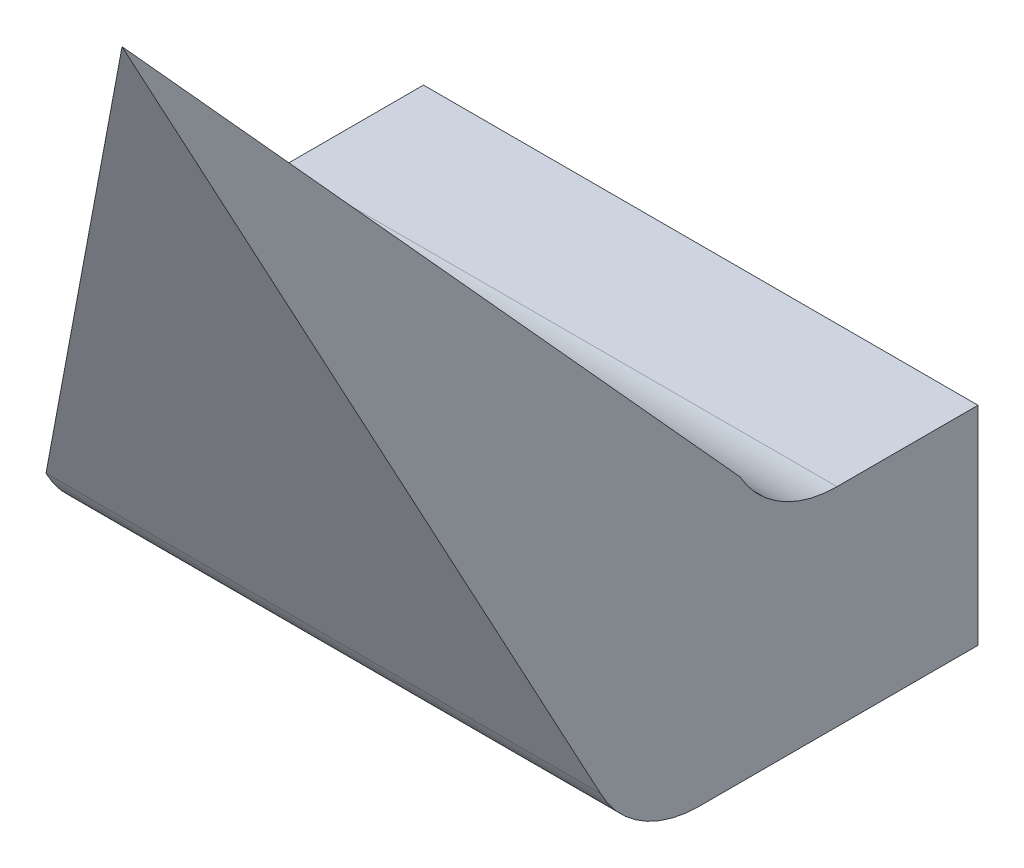
ISO-10303-21;
HEADER;
FILE_DESCRIPTION(('STEP AP214'),'2;1');
FILE_NAME('part.step','',(''),(''),'','','');
FILE_SCHEMA(('AUTOMOTIVE_DESIGN { 1 0 10303 214 1 1 1 1 }'));
ENDSEC;
DATA;
#1=APPLICATION_CONTEXT('core data for automotive mechanical design processes');
#2=APPLICATION_PROTOCOL_DEFINITION('international standard','automotive_design',2000,#1);
#3=PRODUCT_CONTEXT('',#1,'mechanical');
#4=PRODUCT('Part','Part','',(#3));
#5=PRODUCT_RELATED_PRODUCT_CATEGORY('part','',(#4));
#6=PRODUCT_DEFINITION_FORMATION('','',#4);
#7=PRODUCT_DEFINITION_CONTEXT('part definition',#1,'design');
#8=PRODUCT_DEFINITION('design','',#6,#7);
#9=PRODUCT_DEFINITION_SHAPE('','',#8);
#10=(LENGTH_UNIT() NAMED_UNIT(*) SI_UNIT(.MILLI.,.METRE.));
#11=(NAMED_UNIT(*) PLANE_ANGLE_UNIT() SI_UNIT($,.RADIAN.));
#12=(NAMED_UNIT(*) SI_UNIT($,.STERADIAN.) SOLID_ANGLE_UNIT());
#13=UNCERTAINTY_MEASURE_WITH_UNIT(LENGTH_MEASURE(1.E-05),#10,'distance_accuracy_value','');
#14=(GEOMETRIC_REPRESENTATION_CONTEXT(3) GLOBAL_UNCERTAINTY_ASSIGNED_CONTEXT((#13)) GLOBAL_UNIT_ASSIGNED_CONTEXT((#10,
#11,#12)) REPRESENTATION_CONTEXT('',''));
#15=CARTESIAN_POINT('',(0.,0.,0.));
#16=DIRECTION('',(0.,0.,1.));
#17=DIRECTION('',(1.,0.,0.));
#18=AXIS2_PLACEMENT_3D('',#15,#16,#17);
#19=CARTESIAN_POINT('',(-71.13907229268,21.89380350451,21.814122866963));
#20=DIRECTION('',(0.,0.455111059789055,-0.890434682196108));
#21=DIRECTION('',(0.,0.890434682196108,0.455111059789055));
#22=AXIS2_PLACEMENT_3D('',#19,#20,#21);
#23=PLANE('',#22);
#24=DIRECTION('',(-1.,0.,0.));
#25=VECTOR('',#24,1.);
#26=CARTESIAN_POINT('',(-71.13907229268,21.8938035045101,21.8141228669628));
#27=LINE('',#26,#25);
#28=CARTESIAN_POINT('',(-71.13907229268,21.8938035045099,21.8141228669628));
#29=VERTEX_POINT('',#28);
#30=CARTESIAN_POINT('',(-71.53907229268,21.8938035045099,21.8141228669628));
#31=VERTEX_POINT('',#30);
#32=EDGE_CURVE('E83',#29,#31,#27,.T.);
#33=ORIENTED_EDGE('',*,*,#32,.F.);
#34=DIRECTION('',(0.,-0.890434682195817,-0.455111059789624));
#35=VECTOR('',#34,1.);
#36=CARTESIAN_POINT('',(-71.13907229268,22.256621274076,21.999563060297));
#37=LINE('',#36,#35);
#38=CARTESIAN_POINT('',(-71.33907229268,22.3329201022555,21.959256338043));
#39=VERTEX_POINT('',#38);
#40=EDGE_CURVE('E47',#39,#29,#37,.T.);
#41=ORIENTED_EDGE('',*,*,#40,.F.);
#42=DIRECTION('',(0.,-0.890434682195817,-0.455111059789624));
#43=VECTOR('',#42,1.);
#44=CARTESIAN_POINT('',(-71.53907229268,22.256621274076,21.999563060297));
#45=LINE('',#44,#43);
#46=EDGE_CURVE('E97',#39,#31,#45,.T.);
#47=ORIENTED_EDGE('',*,*,#46,.T.);
#48=EDGE_LOOP('',(#33,#41,#47));
#49=FACE_BOUND('',#48,.T.);
#50=ADVANCED_FACE('F17',(#49),#23,.F.);
#51=CARTESIAN_POINT('',(-71.13907229268,21.930212389293,21.742888092387));
#52=DIRECTION('',(-1.,0.,0.));
#53=DIRECTION('',(0.,0.,1.));
#54=AXIS2_PLACEMENT_3D('',#51,#52,#53);
#55=CYLINDRICAL_SURFACE('',#54,0.08);
#56=CARTESIAN_POINT('',(-71.13907229268,21.930212389293,21.742888092387));
#57=DIRECTION('',(-1.,0.,0.));
#58=DIRECTION('',(0.,0.,1.));
#59=AXIS2_PLACEMENT_3D('',#56,#57,#58);
#60=CIRCLE('',#59,0.08);
#61=CARTESIAN_POINT('',(-71.13907229268,21.850212389293,21.742888092387));
#62=VERTEX_POINT('',#61);
#63=EDGE_CURVE('E20',#29,#62,#60,.F.);
#64=ORIENTED_EDGE('',*,*,#63,.F.);
#65=ORIENTED_EDGE('',*,*,#32,.T.);
#66=CARTESIAN_POINT('',(-71.53907229268,21.930212389293,21.742888092387));
#67=DIRECTION('',(-1.,0.,0.));
#68=DIRECTION('',(0.,0.,1.));
#69=AXIS2_PLACEMENT_3D('',#66,#67,#68);
#70=CIRCLE('',#69,0.08);
#71=CARTESIAN_POINT('',(-71.53907229268,21.850212389293,21.742888092387));
#72=VERTEX_POINT('',#71);
#73=EDGE_CURVE('E90',#31,#72,#70,.F.);
#74=ORIENTED_EDGE('',*,*,#73,.T.);
#75=DIRECTION('',(1.,0.,0.));
#76=VECTOR('',#75,1.);
#77=CARTESIAN_POINT('',(-71.13907229268,21.850212389293,21.742888092387));
#78=LINE('',#77,#76);
#79=EDGE_CURVE('E76',#72,#62,#78,.T.);
#80=ORIENTED_EDGE('',*,*,#79,.T.);
#81=EDGE_LOOP('',(#64,#65,#74,#80));
#82=FACE_BOUND('',#81,.T.);
#83=ADVANCED_FACE('F96',(#82),#55,.T.);
#84=CARTESIAN_POINT('',(-71.13907229268,21.850212389293,21.54184296363));
#85=DIRECTION('',(0.,1.,0.));
#86=DIRECTION('',(0.,0.,1.));
#87=AXIS2_PLACEMENT_3D('',#84,#85,#86);
#88=PLANE('',#87);
#89=DIRECTION('',(1.,0.,0.));
#90=VECTOR('',#89,1.);
#91=CARTESIAN_POINT('',(-71.13907229268,21.850212389293,21.54184296363));
#92=LINE('',#91,#90);
#93=CARTESIAN_POINT('',(-71.53907229268,21.850212389293,21.54184296363));
#94=VERTEX_POINT('',#93);
#95=CARTESIAN_POINT('',(-71.13907229268,21.850212389293,21.54184296363));
#96=VERTEX_POINT('',#95);
#97=EDGE_CURVE('E82',#94,#96,#92,.T.);
#98=ORIENTED_EDGE('',*,*,#97,.T.);
#99=DIRECTION('',(0.,0.,-1.));
#100=VECTOR('',#99,1.);
#101=CARTESIAN_POINT('',(-71.13907229268,21.850212389293,21.988795802143));
#102=LINE('',#101,#100);
#103=EDGE_CURVE('E57',#62,#96,#102,.T.);
#104=ORIENTED_EDGE('',*,*,#103,.F.);
#105=ORIENTED_EDGE('',*,*,#79,.F.);
#106=DIRECTION('',(0.,0.,-1.));
#107=VECTOR('',#106,1.);
#108=CARTESIAN_POINT('',(-71.53907229268,21.850212389293,21.988795802143));
#109=LINE('',#108,#107);
#110=EDGE_CURVE('E79',#72,#94,#109,.T.);
#111=ORIENTED_EDGE('',*,*,#110,.T.);
#112=EDGE_LOOP('',(#98,#104,#105,#111));
#113=FACE_BOUND('',#112,.T.);
#114=ADVANCED_FACE('F78',(#113),#88,.F.);
#115=CARTESIAN_POINT('',(-71.13907229268,22.000212389293,21.54184296363));
#116=DIRECTION('',(0.,0.,1.));
#117=DIRECTION('',(1.,0.,0.));
#118=AXIS2_PLACEMENT_3D('',#115,#116,#117);
#119=PLANE('',#118);
#120=DIRECTION('',(1.,0.,0.));
#121=VECTOR('',#120,1.);
#122=CARTESIAN_POINT('',(-71.13907229268,22.000212389293,21.54184296363));
#123=LINE('',#122,#121);
#124=CARTESIAN_POINT('',(-71.53907229268,22.000212389293,21.54184296363));
#125=VERTEX_POINT('',#124);
#126=CARTESIAN_POINT('',(-71.13907229268,22.000212389293,21.54184296363));
#127=VERTEX_POINT('',#126);
#128=EDGE_CURVE('E123',#125,#127,#123,.T.);
#129=ORIENTED_EDGE('',*,*,#128,.T.);
#130=DIRECTION('',(0.,1.,0.));
#131=VECTOR('',#130,1.);
#132=CARTESIAN_POINT('',(-71.13907229268,22.370212389293,21.54184296363));
#133=LINE('',#132,#131);
#134=EDGE_CURVE('E104',#96,#127,#133,.T.);
#135=ORIENTED_EDGE('',*,*,#134,.F.);
#136=ORIENTED_EDGE('',*,*,#97,.F.);
#137=DIRECTION('',(0.,1.,0.));
#138=VECTOR('',#137,1.);
#139=CARTESIAN_POINT('',(-71.53907229268,22.370212389293,21.54184296363));
#140=LINE('',#139,#138);
#141=EDGE_CURVE('E94',#94,#125,#140,.T.);
#142=ORIENTED_EDGE('',*,*,#141,.T.);
#143=EDGE_LOOP('',(#129,#135,#136,#142));
#144=FACE_BOUND('',#143,.T.);
#145=ADVANCED_FACE('F138',(#144),#119,.F.);
#146=CARTESIAN_POINT('',(-71.13907229268,22.000212389293,21.643581579434));
#147=DIRECTION('',(0.,-1.,0.));
#148=DIRECTION('',(0.,0.,-1.));
#149=AXIS2_PLACEMENT_3D('',#146,#147,#148);
#150=PLANE('',#149);
#151=DIRECTION('',(-1.,0.,0.));
#152=VECTOR('',#151,1.);
#153=CARTESIAN_POINT('',(-71.13907229268,22.000212389293,21.643581579434));
#154=LINE('',#153,#152);
#155=CARTESIAN_POINT('',(-71.53907229268,22.000212389293,21.643581579434));
#156=VERTEX_POINT('',#155);
#157=CARTESIAN_POINT('',(-71.13907229268,22.000212389293,21.643581579434));
#158=VERTEX_POINT('',#157);
#159=EDGE_CURVE('E119',#156,#158,#154,.F.);
#160=ORIENTED_EDGE('',*,*,#159,.T.);
#161=DIRECTION('',(0.,0.,-1.));
#162=VECTOR('',#161,1.);
#163=CARTESIAN_POINT('',(-71.13907229268,22.000212389293,21.988795802143));
#164=LINE('',#163,#162);
#165=EDGE_CURVE('E103',#127,#158,#164,.F.);
#166=ORIENTED_EDGE('',*,*,#165,.F.);
#167=ORIENTED_EDGE('',*,*,#128,.F.);
#168=DIRECTION('',(0.,0.,-1.));
#169=VECTOR('',#168,1.);
#170=CARTESIAN_POINT('',(-71.53907229268,22.000212389293,21.988795802143));
#171=LINE('',#170,#169);
#172=EDGE_CURVE('E129',#125,#156,#171,.F.);
#173=ORIENTED_EDGE('',*,*,#172,.T.);
#174=EDGE_LOOP('',(#160,#166,#167,#173));
#175=FACE_BOUND('',#174,.T.);
#176=ADVANCED_FACE('F151',(#175),#150,.F.);
#177=CARTESIAN_POINT('',(-71.13907229268,22.080212389293,21.643581579434));
#178=DIRECTION('',(-1.,0.,0.));
#179=DIRECTION('',(0.,0.,1.));
#180=AXIS2_PLACEMENT_3D('',#177,#178,#179);
#181=CYLINDRICAL_SURFACE('',#180,0.08);
#182=CARTESIAN_POINT('',(-71.13907229268,22.080212389293,21.643581579434));
#183=DIRECTION('',(-1.,0.,0.));
#184=DIRECTION('',(0.,0.,1.));
#185=AXIS2_PLACEMENT_3D('',#182,#183,#184);
#186=CIRCLE('',#185,0.08);
#187=CARTESIAN_POINT('',(-71.13907229268,22.0412058481509,21.7134277657873));
#188=VERTEX_POINT('',#187);
#189=EDGE_CURVE('E35',#158,#188,#186,.T.);
#190=ORIENTED_EDGE('',*,*,#189,.F.);
#191=ORIENTED_EDGE('',*,*,#159,.F.);
#192=CARTESIAN_POINT('',(-71.53907229268,22.080212389293,21.643581579434));
#193=DIRECTION('',(-1.,0.,0.));
#194=DIRECTION('',(0.,0.,1.));
#195=AXIS2_PLACEMENT_3D('',#192,#193,#194);
#196=CIRCLE('',#195,0.08);
#197=CARTESIAN_POINT('',(-71.53907229268,22.0412058481509,21.7134277657873));
#198=VERTEX_POINT('',#197);
#199=EDGE_CURVE('E101',#156,#198,#196,.T.);
#200=ORIENTED_EDGE('',*,*,#199,.T.);
#201=DIRECTION('',(1.,0.,0.));
#202=VECTOR('',#201,1.);
#203=CARTESIAN_POINT('',(-71.13907229268,22.0412058481508,21.7134277657873));
#204=LINE('',#203,#202);
#205=EDGE_CURVE('E161',#198,#188,#204,.T.);
#206=ORIENTED_EDGE('',*,*,#205,.T.);
#207=EDGE_LOOP('',(#190,#191,#200,#206));
#208=FACE_BOUND('',#207,.T.);
#209=ADVANCED_FACE('F142',(#208),#181,.F.);
#210=CARTESIAN_POINT('',(-71.13907229268,22.370212389293,21.988795802143));
#211=DIRECTION('',(1.,0.,0.));
#212=DIRECTION('',(0.,0.,-1.));
#213=AXIS2_PLACEMENT_3D('',#210,#211,#212);
#214=PLANE('',#213);
#215=DIRECTION('',(0.,-0.873077329419039,-0.487581764276022));
#216=VECTOR('',#215,1.);
#217=CARTESIAN_POINT('',(-71.13907229268,22.409218930435,21.918949615789));
#218=LINE('',#217,#216);
#219=EDGE_CURVE('E26',#188,#39,#218,.F.);
#220=ORIENTED_EDGE('',*,*,#219,.T.);
#221=ORIENTED_EDGE('',*,*,#40,.T.);
#222=ORIENTED_EDGE('',*,*,#63,.T.);
#223=ORIENTED_EDGE('',*,*,#103,.T.);
#224=ORIENTED_EDGE('',*,*,#134,.T.);
#225=ORIENTED_EDGE('',*,*,#165,.T.);
#226=ORIENTED_EDGE('',*,*,#189,.T.);
#227=EDGE_LOOP('',(#220,#221,#222,#223,#224,#225,#226));
#228=FACE_BOUND('',#227,.T.);
#229=ADVANCED_FACE('F140',(#228),#214,.T.);
#230=CARTESIAN_POINT('',(-71.53907229268,22.370212389293,21.988795802143));
#231=DIRECTION('',(1.,0.,0.));
#232=DIRECTION('',(0.,0.,-1.));
#233=AXIS2_PLACEMENT_3D('',#230,#231,#232);
#234=PLANE('',#233);
#235=DIRECTION('',(0.,-0.873077329419039,-0.487581764276022));
#236=VECTOR('',#235,1.);
#237=CARTESIAN_POINT('',(-71.53907229268,22.409218930435,21.918949615789));
#238=LINE('',#237,#236);
#239=EDGE_CURVE('E11',#39,#198,#238,.T.);
#240=ORIENTED_EDGE('',*,*,#239,.T.);
#241=ORIENTED_EDGE('',*,*,#199,.F.);
#242=ORIENTED_EDGE('',*,*,#172,.F.);
#243=ORIENTED_EDGE('',*,*,#141,.F.);
#244=ORIENTED_EDGE('',*,*,#110,.F.);
#245=ORIENTED_EDGE('',*,*,#73,.F.);
#246=ORIENTED_EDGE('',*,*,#46,.F.);
#247=EDGE_LOOP('',(#240,#241,#242,#243,#244,#245,#246));
#248=FACE_BOUND('',#247,.T.);
#249=ADVANCED_FACE('F88',(#248),#234,.F.);
#250=CARTESIAN_POINT('',(-71.13907229268,22.409218930435,21.918949615789));
#251=DIRECTION('',(0.,-0.487581764276022,0.873077329419039));
#252=DIRECTION('',(0.,-0.873077329419039,-0.487581764276022));
#253=AXIS2_PLACEMENT_3D('',#250,#251,#252);
#254=PLANE('',#253);
#255=ORIENTED_EDGE('',*,*,#219,.F.);
#256=ORIENTED_EDGE('',*,*,#205,.F.);
#257=ORIENTED_EDGE('',*,*,#239,.F.);
#258=EDGE_LOOP('',(#255,#256,#257));
#259=FACE_BOUND('',#258,.T.);
#260=ADVANCED_FACE('F149',(#259),#254,.F.);
#261=CLOSED_SHELL('',(#50,#83,#114,#145,#176,#209,#229,#249,#260));
#262=MANIFOLD_SOLID_BREP('B1',#261);
#263=ADVANCED_BREP_SHAPE_REPRESENTATION('',(#18,#262),#14);
#264=SHAPE_DEFINITION_REPRESENTATION(#9,#263);
ENDSEC;
END-ISO-10303-21;
